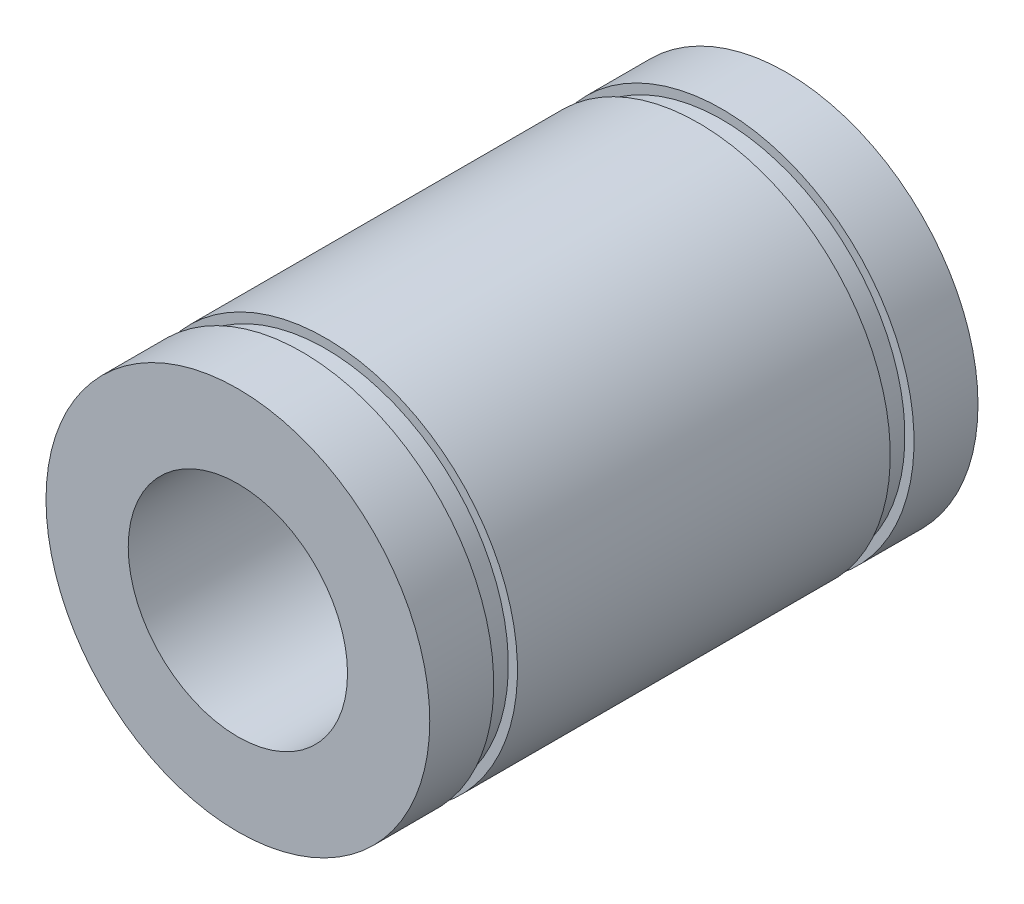
ISO-10303-21;
HEADER;
FILE_DESCRIPTION(('STEP AP214'),'2;1');
FILE_NAME('part.step','',(''),(''),'','','');
FILE_SCHEMA(('AUTOMOTIVE_DESIGN { 1 0 10303 214 1 1 1 1 }'));
ENDSEC;
DATA;
#1=APPLICATION_CONTEXT('core data for automotive mechanical design processes');
#2=APPLICATION_PROTOCOL_DEFINITION('international standard','automotive_design',2000,#1);
#3=PRODUCT_CONTEXT('',#1,'mechanical');
#4=PRODUCT('Part','Part','',(#3));
#5=PRODUCT_RELATED_PRODUCT_CATEGORY('part','',(#4));
#6=PRODUCT_DEFINITION_FORMATION('','',#4);
#7=PRODUCT_DEFINITION_CONTEXT('part definition',#1,'design');
#8=PRODUCT_DEFINITION('design','',#6,#7);
#9=PRODUCT_DEFINITION_SHAPE('','',#8);
#10=(LENGTH_UNIT() NAMED_UNIT(*) SI_UNIT(.MILLI.,.METRE.));
#11=(NAMED_UNIT(*) PLANE_ANGLE_UNIT() SI_UNIT($,.RADIAN.));
#12=(NAMED_UNIT(*) SI_UNIT($,.STERADIAN.) SOLID_ANGLE_UNIT());
#13=UNCERTAINTY_MEASURE_WITH_UNIT(LENGTH_MEASURE(1.E-05),#10,'distance_accuracy_value','');
#14=(GEOMETRIC_REPRESENTATION_CONTEXT(3) GLOBAL_UNCERTAINTY_ASSIGNED_CONTEXT((#13)) GLOBAL_UNIT_ASSIGNED_CONTEXT((#10,
#11,#12)) REPRESENTATION_CONTEXT('',''));
#15=CARTESIAN_POINT('',(0.,0.,0.));
#16=DIRECTION('',(0.,0.,1.));
#17=DIRECTION('',(1.,0.,0.));
#18=AXIS2_PLACEMENT_3D('',#15,#16,#17);
#19=CARTESIAN_POINT('',(0.,0.,30.));
#20=DIRECTION('',(0.,0.,-1.));
#21=DIRECTION('',(-1.,0.,0.));
#22=AXIS2_PLACEMENT_3D('',#19,#20,#21);
#23=CYLINDRICAL_SURFACE('',#22,10.5);
#24=CARTESIAN_POINT('',(0.,0.,26.5));
#25=DIRECTION('',(0.,0.,-1.));
#26=DIRECTION('',(-1.,0.,0.));
#27=AXIS2_PLACEMENT_3D('',#24,#25,#26);
#28=CIRCLE('',#27,10.5);
#29=CARTESIAN_POINT('',(-10.5,0.,26.5));
#30=VERTEX_POINT('',#29);
#31=EDGE_CURVE('E59',#30,#30,#28,.T.);
#32=ORIENTED_EDGE('',*,*,#31,.F.);
#33=EDGE_LOOP('',(#32));
#34=FACE_BOUND('',#33,.T.);
#35=CARTESIAN_POINT('',(0.,0.,30.));
#36=DIRECTION('',(0.,0.,1.));
#37=DIRECTION('',(1.,0.,0.));
#38=AXIS2_PLACEMENT_3D('',#35,#36,#37);
#39=CIRCLE('',#38,10.5);
#40=CARTESIAN_POINT('',(10.5,0.,30.));
#41=VERTEX_POINT('',#40);
#42=EDGE_CURVE('E10',#41,#41,#39,.T.);
#43=ORIENTED_EDGE('',*,*,#42,.F.);
#44=EDGE_LOOP('',(#43));
#45=FACE_BOUND('',#44,.T.);
#46=ADVANCED_FACE('F37',(#34,#45),#23,.T.);
#47=CARTESIAN_POINT('',(0.,0.,3.5));
#48=DIRECTION('',(0.,0.,-1.));
#49=DIRECTION('',(-1.,0.,0.));
#50=AXIS2_PLACEMENT_3D('',#47,#48,#49);
#51=CIRCLE('',#50,10.5);
#52=CARTESIAN_POINT('',(-10.5,0.,3.5));
#53=VERTEX_POINT('',#52);
#54=EDGE_CURVE('E65',#53,#53,#51,.T.);
#55=ORIENTED_EDGE('',*,*,#54,.T.);
#56=EDGE_LOOP('',(#55));
#57=FACE_BOUND('',#56,.T.);
#58=CARTESIAN_POINT('',(0.,0.,0.));
#59=DIRECTION('',(0.,0.,1.));
#60=DIRECTION('',(1.,0.,0.));
#61=AXIS2_PLACEMENT_3D('',#58,#59,#60);
#62=CIRCLE('',#61,10.5);
#63=CARTESIAN_POINT('',(10.5,0.,0.));
#64=VERTEX_POINT('',#63);
#65=EDGE_CURVE('E41',#64,#64,#62,.T.);
#66=ORIENTED_EDGE('',*,*,#65,.T.);
#67=EDGE_LOOP('',(#66));
#68=FACE_BOUND('',#67,.T.);
#69=ADVANCED_FACE('F39',(#57,#68),#23,.T.);
#70=CARTESIAN_POINT('',(0.,0.,30.));
#71=DIRECTION('',(0.,0.,1.));
#72=DIRECTION('',(1.,0.,0.));
#73=AXIS2_PLACEMENT_3D('',#70,#71,#72);
#74=PLANE('',#73);
#75=CARTESIAN_POINT('',(0.,0.,30.));
#76=DIRECTION('',(0.,0.,1.));
#77=DIRECTION('',(1.,0.,0.));
#78=AXIS2_PLACEMENT_3D('',#75,#76,#77);
#79=CIRCLE('',#78,6.);
#80=CARTESIAN_POINT('',(6.,0.,30.));
#81=VERTEX_POINT('',#80);
#82=EDGE_CURVE('E50',#81,#81,#79,.T.);
#83=ORIENTED_EDGE('',*,*,#82,.F.);
#84=EDGE_LOOP('',(#83));
#85=FACE_BOUND('',#84,.T.);
#86=ORIENTED_EDGE('',*,*,#42,.T.);
#87=EDGE_LOOP('',(#86));
#88=FACE_BOUND('',#87,.T.);
#89=ADVANCED_FACE('F118',(#85,#88),#74,.T.);
#90=CARTESIAN_POINT('',(0.,0.,0.));
#91=DIRECTION('',(0.,0.,1.));
#92=DIRECTION('',(1.,0.,0.));
#93=AXIS2_PLACEMENT_3D('',#90,#91,#92);
#94=PLANE('',#93);
#95=CARTESIAN_POINT('',(0.,0.,0.));
#96=DIRECTION('',(0.,0.,1.));
#97=DIRECTION('',(1.,0.,0.));
#98=AXIS2_PLACEMENT_3D('',#95,#96,#97);
#99=CIRCLE('',#98,6.);
#100=CARTESIAN_POINT('',(6.,0.,0.));
#101=VERTEX_POINT('',#100);
#102=EDGE_CURVE('E55',#101,#101,#99,.T.);
#103=ORIENTED_EDGE('',*,*,#102,.T.);
#104=EDGE_LOOP('',(#103));
#105=FACE_BOUND('',#104,.T.);
#106=ORIENTED_EDGE('',*,*,#65,.F.);
#107=EDGE_LOOP('',(#106));
#108=FACE_BOUND('',#107,.T.);
#109=ADVANCED_FACE('F143',(#105,#108),#94,.F.);
#110=CARTESIAN_POINT('',(0.,0.,0.));
#111=DIRECTION('',(0.,0.,1.));
#112=DIRECTION('',(1.,0.,0.));
#113=AXIS2_PLACEMENT_3D('',#110,#111,#112);
#114=CYLINDRICAL_SURFACE('',#113,6.);
#115=ORIENTED_EDGE('',*,*,#82,.T.);
#116=EDGE_LOOP('',(#115));
#117=FACE_BOUND('',#116,.T.);
#118=ORIENTED_EDGE('',*,*,#102,.F.);
#119=EDGE_LOOP('',(#118));
#120=FACE_BOUND('',#119,.T.);
#121=ADVANCED_FACE('F139',(#117,#120),#114,.F.);
#122=CARTESIAN_POINT('',(0.,10.,4.8));
#123=DIRECTION('',(0.,0.,1.));
#124=DIRECTION('',(1.,0.,0.));
#125=AXIS2_PLACEMENT_3D('',#122,#123,#124);
#126=PLANE('',#125);
#127=CARTESIAN_POINT('',(0.,0.,4.8));
#128=DIRECTION('',(0.,0.,-1.));
#129=DIRECTION('',(-1.,0.,0.));
#130=AXIS2_PLACEMENT_3D('',#127,#128,#129);
#131=CIRCLE('',#130,10.);
#132=CARTESIAN_POINT('',(-10.,0.,4.8));
#133=VERTEX_POINT('',#132);
#134=EDGE_CURVE('E73',#133,#133,#131,.T.);
#135=ORIENTED_EDGE('',*,*,#134,.F.);
#136=EDGE_LOOP('',(#135));
#137=FACE_BOUND('',#136,.T.);
#138=CARTESIAN_POINT('',(0.,0.,4.8));
#139=DIRECTION('',(0.,0.,-1.));
#140=DIRECTION('',(-1.,0.,0.));
#141=AXIS2_PLACEMENT_3D('',#138,#139,#140);
#142=CIRCLE('',#141,10.5);
#143=CARTESIAN_POINT('',(-10.5,0.,4.8));
#144=VERTEX_POINT('',#143);
#145=EDGE_CURVE('E60',#144,#144,#142,.T.);
#146=ORIENTED_EDGE('',*,*,#145,.T.);
#147=EDGE_LOOP('',(#146));
#148=FACE_BOUND('',#147,.T.);
#149=ADVANCED_FACE('F131',(#137,#148),#126,.F.);
#150=CARTESIAN_POINT('',(0.,10.5,3.5));
#151=DIRECTION('',(0.,0.,-1.));
#152=DIRECTION('',(-1.,0.,0.));
#153=AXIS2_PLACEMENT_3D('',#150,#151,#152);
#154=PLANE('',#153);
#155=ORIENTED_EDGE('',*,*,#54,.F.);
#156=EDGE_LOOP('',(#155));
#157=FACE_BOUND('',#156,.T.);
#158=CARTESIAN_POINT('',(0.,0.,3.5));
#159=DIRECTION('',(0.,0.,-1.));
#160=DIRECTION('',(-1.,0.,0.));
#161=AXIS2_PLACEMENT_3D('',#158,#159,#160);
#162=CIRCLE('',#161,10.);
#163=CARTESIAN_POINT('',(-10.,0.,3.5));
#164=VERTEX_POINT('',#163);
#165=EDGE_CURVE('E69',#164,#164,#162,.T.);
#166=ORIENTED_EDGE('',*,*,#165,.T.);
#167=EDGE_LOOP('',(#166));
#168=FACE_BOUND('',#167,.T.);
#169=ADVANCED_FACE('F125',(#157,#168),#154,.F.);
#170=CARTESIAN_POINT('',(0.,0.,-1.45700024163234));
#171=DIRECTION('',(0.,0.,-1.));
#172=DIRECTION('',(-1.,0.,0.));
#173=AXIS2_PLACEMENT_3D('',#170,#171,#172);
#174=CYLINDRICAL_SURFACE('',#173,10.);
#175=ORIENTED_EDGE('',*,*,#165,.F.);
#176=EDGE_LOOP('',(#175));
#177=FACE_BOUND('',#176,.T.);
#178=ORIENTED_EDGE('',*,*,#134,.T.);
#179=EDGE_LOOP('',(#178));
#180=FACE_BOUND('',#179,.T.);
#181=ADVANCED_FACE('F121',(#177,#180),#174,.T.);
#182=CARTESIAN_POINT('',(0.,0.,25.2));
#183=DIRECTION('',(0.,0.,-1.));
#184=DIRECTION('',(-1.,0.,0.));
#185=AXIS2_PLACEMENT_3D('',#182,#183,#184);
#186=CIRCLE('',#185,10.5);
#187=CARTESIAN_POINT('',(-10.5,0.,25.2));
#188=VERTEX_POINT('',#187);
#189=EDGE_CURVE('E64',#188,#188,#186,.T.);
#190=ORIENTED_EDGE('',*,*,#189,.T.);
#191=EDGE_LOOP('',(#190));
#192=FACE_BOUND('',#191,.T.);
#193=ORIENTED_EDGE('',*,*,#145,.F.);
#194=EDGE_LOOP('',(#193));
#195=FACE_BOUND('',#194,.T.);
#196=ADVANCED_FACE('F92',(#192,#195),#23,.T.);
#197=CARTESIAN_POINT('',(0.,10.5,26.5));
#198=DIRECTION('',(0.,0.,1.));
#199=DIRECTION('',(1.,0.,0.));
#200=AXIS2_PLACEMENT_3D('',#197,#198,#199);
#201=PLANE('',#200);
#202=CARTESIAN_POINT('',(0.,0.,26.5));
#203=DIRECTION('',(0.,0.,-1.));
#204=DIRECTION('',(-1.,0.,0.));
#205=AXIS2_PLACEMENT_3D('',#202,#203,#204);
#206=CIRCLE('',#205,10.);
#207=CARTESIAN_POINT('',(-10.,0.,26.5));
#208=VERTEX_POINT('',#207);
#209=EDGE_CURVE('E80',#208,#208,#206,.T.);
#210=ORIENTED_EDGE('',*,*,#209,.F.);
#211=EDGE_LOOP('',(#210));
#212=FACE_BOUND('',#211,.T.);
#213=ORIENTED_EDGE('',*,*,#31,.T.);
#214=EDGE_LOOP('',(#213));
#215=FACE_BOUND('',#214,.T.);
#216=ADVANCED_FACE('F104',(#212,#215),#201,.F.);
#217=CARTESIAN_POINT('',(0.,0.,-1.45700024163234));
#218=DIRECTION('',(0.,0.,-1.));
#219=DIRECTION('',(-1.,0.,0.));
#220=AXIS2_PLACEMENT_3D('',#217,#218,#219);
#221=CYLINDRICAL_SURFACE('',#220,10.);
#222=CARTESIAN_POINT('',(0.,0.,25.2));
#223=DIRECTION('',(0.,0.,-1.));
#224=DIRECTION('',(-1.,0.,0.));
#225=AXIS2_PLACEMENT_3D('',#222,#223,#224);
#226=CIRCLE('',#225,10.);
#227=CARTESIAN_POINT('',(-10.,0.,25.2));
#228=VERTEX_POINT('',#227);
#229=EDGE_CURVE('E84',#228,#228,#226,.T.);
#230=ORIENTED_EDGE('',*,*,#229,.F.);
#231=EDGE_LOOP('',(#230));
#232=FACE_BOUND('',#231,.T.);
#233=ORIENTED_EDGE('',*,*,#209,.T.);
#234=EDGE_LOOP('',(#233));
#235=FACE_BOUND('',#234,.T.);
#236=ADVANCED_FACE('F98',(#232,#235),#221,.T.);
#237=CARTESIAN_POINT('',(0.,10.,25.2));
#238=DIRECTION('',(0.,0.,-1.));
#239=DIRECTION('',(-1.,0.,0.));
#240=AXIS2_PLACEMENT_3D('',#237,#238,#239);
#241=PLANE('',#240);
#242=ORIENTED_EDGE('',*,*,#189,.F.);
#243=EDGE_LOOP('',(#242));
#244=FACE_BOUND('',#243,.T.);
#245=ORIENTED_EDGE('',*,*,#229,.T.);
#246=EDGE_LOOP('',(#245));
#247=FACE_BOUND('',#246,.T.);
#248=ADVANCED_FACE('F95',(#244,#247),#241,.F.);
#249=CLOSED_SHELL('',(#46,#69,#89,#109,#121,#149,#169,#181,#196,#216,#236,#248));
#250=MANIFOLD_SOLID_BREP('B2',#249);
#251=ADVANCED_BREP_SHAPE_REPRESENTATION('',(#18,#250),#14);
#252=SHAPE_DEFINITION_REPRESENTATION(#9,#251);
ENDSEC;
END-ISO-10303-21;
